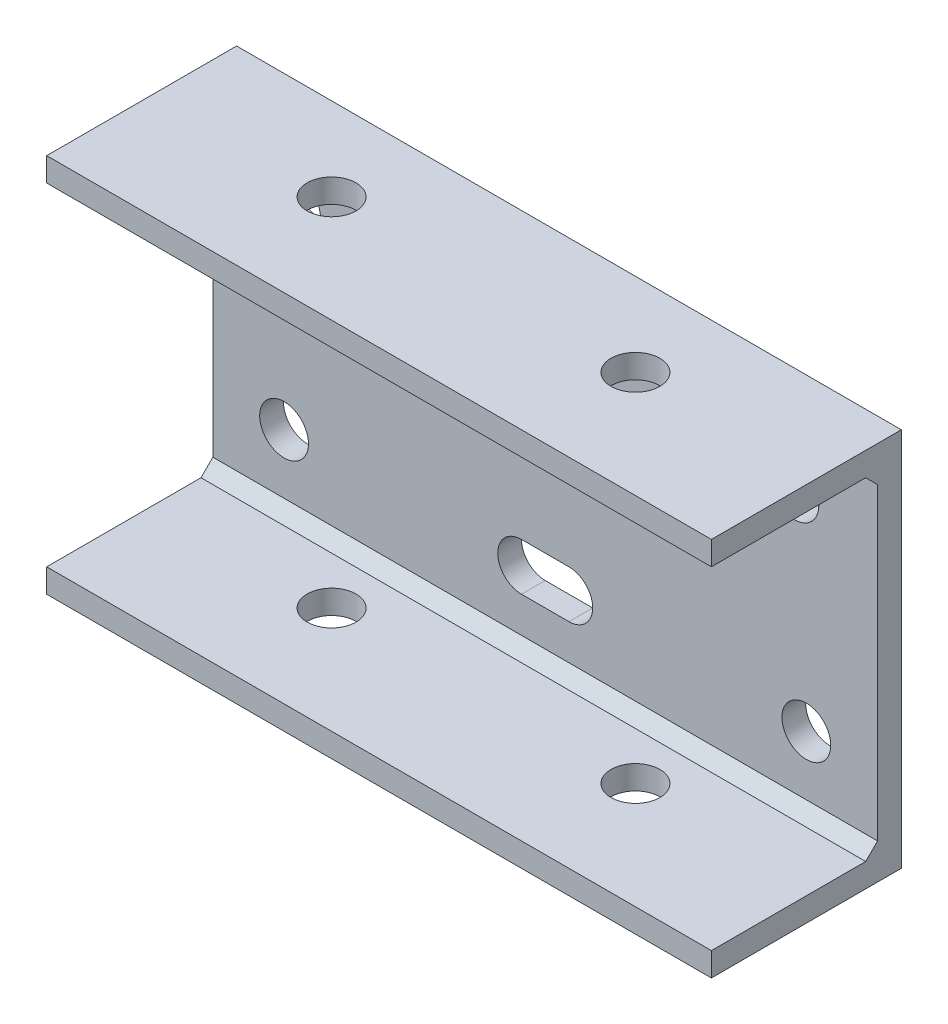
ISO-10303-21;
HEADER;
FILE_DESCRIPTION(('STEP AP214'),'2;1');
FILE_NAME('part.step','',(''),(''),'','','');
FILE_SCHEMA(('AUTOMOTIVE_DESIGN { 1 0 10303 214 1 1 1 1 }'));
ENDSEC;
DATA;
#1=APPLICATION_CONTEXT('core data for automotive mechanical design processes');
#2=APPLICATION_PROTOCOL_DEFINITION('international standard','automotive_design',2000,#1);
#3=PRODUCT_CONTEXT('',#1,'mechanical');
#4=PRODUCT('Part','Part','',(#3));
#5=PRODUCT_RELATED_PRODUCT_CATEGORY('part','',(#4));
#6=PRODUCT_DEFINITION_FORMATION('','',#4);
#7=PRODUCT_DEFINITION_CONTEXT('part definition',#1,'design');
#8=PRODUCT_DEFINITION('design','',#6,#7);
#9=PRODUCT_DEFINITION_SHAPE('','',#8);
#10=(LENGTH_UNIT() NAMED_UNIT(*) SI_UNIT(.MILLI.,.METRE.));
#11=(NAMED_UNIT(*) PLANE_ANGLE_UNIT() SI_UNIT($,.RADIAN.));
#12=(NAMED_UNIT(*) SI_UNIT($,.STERADIAN.) SOLID_ANGLE_UNIT());
#13=UNCERTAINTY_MEASURE_WITH_UNIT(LENGTH_MEASURE(1.E-05),#10,'distance_accuracy_value','');
#14=(GEOMETRIC_REPRESENTATION_CONTEXT(3) GLOBAL_UNCERTAINTY_ASSIGNED_CONTEXT((#13)) GLOBAL_UNIT_ASSIGNED_CONTEXT((#10,
#11,#12)) REPRESENTATION_CONTEXT('',''));
#15=CARTESIAN_POINT('',(0.,0.,0.));
#16=DIRECTION('',(0.,0.,1.));
#17=DIRECTION('',(1.,0.,0.));
#18=AXIS2_PLACEMENT_3D('',#15,#16,#17);
#19=CARTESIAN_POINT('',(23.8252,24.7399999992,11.1252));
#20=DIRECTION('',(0.,1.,0.));
#21=DIRECTION('',(0.,0.,1.));
#22=AXIS2_PLACEMENT_3D('',#19,#20,#21);
#23=CYLINDRICAL_SURFACE('',#22,3.2639);
#24=CARTESIAN_POINT('',(23.8252,50.8,11.1252));
#25=DIRECTION('',(0.,1.,0.));
#26=DIRECTION('',(0.,0.,1.));
#27=AXIS2_PLACEMENT_3D('',#24,#25,#26);
#28=CIRCLE('',#27,3.2639);
#29=CARTESIAN_POINT('',(23.8252,50.8,14.3891));
#30=VERTEX_POINT('',#29);
#31=EDGE_CURVE('E145',#30,#30,#28,.T.);
#32=ORIENTED_EDGE('',*,*,#31,.T.);
#33=EDGE_LOOP('',(#32));
#34=FACE_BOUND('',#33,.T.);
#35=CARTESIAN_POINT('',(23.8252,47.625,11.1252));
#36=DIRECTION('',(0.,1.,0.));
#37=DIRECTION('',(0.,0.,1.));
#38=AXIS2_PLACEMENT_3D('',#35,#36,#37);
#39=CIRCLE('',#38,3.2639);
#40=CARTESIAN_POINT('',(23.8252,47.625,14.3891));
#41=VERTEX_POINT('',#40);
#42=EDGE_CURVE('E20',#41,#41,#39,.F.);
#43=ORIENTED_EDGE('',*,*,#42,.T.);
#44=EDGE_LOOP('',(#43));
#45=FACE_BOUND('',#44,.T.);
#46=ADVANCED_FACE('F17',(#34,#45),#23,.F.);
#47=CARTESIAN_POINT('',(64.4652,24.7399999992,11.1252));
#48=DIRECTION('',(0.,1.,0.));
#49=DIRECTION('',(0.,0.,1.));
#50=AXIS2_PLACEMENT_3D('',#47,#48,#49);
#51=CYLINDRICAL_SURFACE('',#50,3.2639);
#52=CARTESIAN_POINT('',(64.4652,50.8,11.1252));
#53=DIRECTION('',(0.,1.,0.));
#54=DIRECTION('',(0.,0.,1.));
#55=AXIS2_PLACEMENT_3D('',#52,#53,#54);
#56=CIRCLE('',#55,3.2639);
#57=CARTESIAN_POINT('',(64.4652,50.8,14.3891));
#58=VERTEX_POINT('',#57);
#59=EDGE_CURVE('E141',#58,#58,#56,.T.);
#60=ORIENTED_EDGE('',*,*,#59,.T.);
#61=EDGE_LOOP('',(#60));
#62=FACE_BOUND('',#61,.T.);
#63=CARTESIAN_POINT('',(64.4652,47.625,11.1252));
#64=DIRECTION('',(0.,1.,0.));
#65=DIRECTION('',(0.,0.,1.));
#66=AXIS2_PLACEMENT_3D('',#63,#64,#65);
#67=CIRCLE('',#66,3.2639);
#68=CARTESIAN_POINT('',(64.4652,47.625,14.3891));
#69=VERTEX_POINT('',#68);
#70=EDGE_CURVE('E97',#69,#69,#67,.F.);
#71=ORIENTED_EDGE('',*,*,#70,.T.);
#72=EDGE_LOOP('',(#71));
#73=FACE_BOUND('',#72,.T.);
#74=ADVANCED_FACE('F474',(#62,#73),#51,.F.);
#75=CARTESIAN_POINT('',(44.45,3.175,4.7625));
#76=DIRECTION('',(0.,0.707106781186548,0.707106781186548));
#77=DIRECTION('',(0.,-0.707106781186548,0.707106781186548));
#78=AXIS2_PLACEMENT_3D('',#75,#76,#77);
#79=PLANE('',#78);
#80=DIRECTION('',(0.,-0.707106781186547,0.707106781186547));
#81=VECTOR('',#80,1.);
#82=CARTESIAN_POINT('',(88.9,4.7625,3.175));
#83=LINE('',#82,#81);
#84=CARTESIAN_POINT('',(88.9,4.7625,3.175));
#85=VERTEX_POINT('',#84);
#86=CARTESIAN_POINT('',(88.9,3.175,4.7625));
#87=VERTEX_POINT('',#86);
#88=EDGE_CURVE('E197',#85,#87,#83,.T.);
#89=ORIENTED_EDGE('',*,*,#88,.F.);
#90=DIRECTION('',(-1.,0.,0.));
#91=VECTOR('',#90,1.);
#92=CARTESIAN_POINT('',(0.,4.7625,3.175));
#93=LINE('',#92,#91);
#94=CARTESIAN_POINT('',(0.,4.7625,3.175));
#95=VERTEX_POINT('',#94);
#96=EDGE_CURVE('E199',#85,#95,#93,.T.);
#97=ORIENTED_EDGE('',*,*,#96,.T.);
#98=DIRECTION('',(0.,-0.707106781186547,0.707106781186547));
#99=VECTOR('',#98,1.);
#100=CARTESIAN_POINT('',(0.,4.7625,3.175));
#101=LINE('',#100,#99);
#102=CARTESIAN_POINT('',(0.,3.175,4.7625));
#103=VERTEX_POINT('',#102);
#104=EDGE_CURVE('E144',#95,#103,#101,.T.);
#105=ORIENTED_EDGE('',*,*,#104,.T.);
#106=DIRECTION('',(1.,0.,0.));
#107=VECTOR('',#106,1.);
#108=CARTESIAN_POINT('',(0.,3.175,4.7625));
#109=LINE('',#108,#107);
#110=EDGE_CURVE('E101',#103,#87,#109,.T.);
#111=ORIENTED_EDGE('',*,*,#110,.T.);
#112=EDGE_LOOP('',(#89,#97,#105,#111));
#113=FACE_BOUND('',#112,.T.);
#114=ADVANCED_FACE('F464',(#113),#79,.T.);
#115=CARTESIAN_POINT('',(0.,3.175,25.4));
#116=DIRECTION('',(0.,-1.,0.));
#117=DIRECTION('',(0.,0.,-1.));
#118=AXIS2_PLACEMENT_3D('',#115,#116,#117);
#119=PLANE('',#118);
#120=CARTESIAN_POINT('',(64.4652,3.175,11.1252));
#121=DIRECTION('',(0.,1.,0.));
#122=DIRECTION('',(0.,0.,1.));
#123=AXIS2_PLACEMENT_3D('',#120,#121,#122);
#124=CIRCLE('',#123,3.2639);
#125=CARTESIAN_POINT('',(64.4652,3.175,14.3891));
#126=VERTEX_POINT('',#125);
#127=EDGE_CURVE('E149',#126,#126,#124,.F.);
#128=ORIENTED_EDGE('',*,*,#127,.T.);
#129=EDGE_LOOP('',(#128));
#130=FACE_BOUND('',#129,.T.);
#131=CARTESIAN_POINT('',(23.8252,3.175,11.1252));
#132=DIRECTION('',(0.,1.,0.));
#133=DIRECTION('',(0.,0.,1.));
#134=AXIS2_PLACEMENT_3D('',#131,#132,#133);
#135=CIRCLE('',#134,3.2639);
#136=CARTESIAN_POINT('',(23.8252,3.175,14.3891));
#137=VERTEX_POINT('',#136);
#138=EDGE_CURVE('E93',#137,#137,#135,.F.);
#139=ORIENTED_EDGE('',*,*,#138,.T.);
#140=EDGE_LOOP('',(#139));
#141=FACE_BOUND('',#140,.T.);
#142=DIRECTION('',(0.,0.,-1.));
#143=VECTOR('',#142,1.);
#144=CARTESIAN_POINT('',(0.,3.175,0.));
#145=LINE('',#144,#143);
#146=CARTESIAN_POINT('',(0.,3.175,25.4));
#147=VERTEX_POINT('',#146);
#148=EDGE_CURVE('E229',#103,#147,#145,.F.);
#149=ORIENTED_EDGE('',*,*,#148,.T.);
#150=DIRECTION('',(-1.,0.,0.));
#151=VECTOR('',#150,1.);
#152=CARTESIAN_POINT('',(0.,3.175,25.4));
#153=LINE('',#152,#151);
#154=CARTESIAN_POINT('',(88.9,3.175,25.4));
#155=VERTEX_POINT('',#154);
#156=EDGE_CURVE('E90',#147,#155,#153,.F.);
#157=ORIENTED_EDGE('',*,*,#156,.T.);
#158=DIRECTION('',(0.,0.,-1.));
#159=VECTOR('',#158,1.);
#160=CARTESIAN_POINT('',(88.9,3.175,0.));
#161=LINE('',#160,#159);
#162=EDGE_CURVE('E194',#87,#155,#161,.F.);
#163=ORIENTED_EDGE('',*,*,#162,.F.);
#164=ORIENTED_EDGE('',*,*,#110,.F.);
#165=EDGE_LOOP('',(#149,#157,#163,#164));
#166=FACE_BOUND('',#165,.T.);
#167=ADVANCED_FACE('F454',(#130,#141,#166),#119,.F.);
#168=CARTESIAN_POINT('',(0.,47.625,25.4));
#169=DIRECTION('',(0.,0.,-1.));
#170=DIRECTION('',(-1.,0.,0.));
#171=AXIS2_PLACEMENT_3D('',#168,#169,#170);
#172=PLANE('',#171);
#173=DIRECTION('',(0.,1.,0.));
#174=VECTOR('',#173,1.);
#175=CARTESIAN_POINT('',(0.,0.,25.4));
#176=LINE('',#175,#174);
#177=CARTESIAN_POINT('',(0.,50.8,25.4));
#178=VERTEX_POINT('',#177);
#179=CARTESIAN_POINT('',(0.,47.625,25.4));
#180=VERTEX_POINT('',#179);
#181=EDGE_CURVE('E238',#178,#180,#176,.F.);
#182=ORIENTED_EDGE('',*,*,#181,.T.);
#183=DIRECTION('',(1.,0.,0.));
#184=VECTOR('',#183,1.);
#185=CARTESIAN_POINT('',(0.,47.625,25.4));
#186=LINE('',#185,#184);
#187=CARTESIAN_POINT('',(88.9,47.625,25.4));
#188=VERTEX_POINT('',#187);
#189=EDGE_CURVE('E98',#180,#188,#186,.T.);
#190=ORIENTED_EDGE('',*,*,#189,.T.);
#191=DIRECTION('',(0.,1.,0.));
#192=VECTOR('',#191,1.);
#193=CARTESIAN_POINT('',(88.9,0.,25.4));
#194=LINE('',#193,#192);
#195=CARTESIAN_POINT('',(88.9,50.8,25.4));
#196=VERTEX_POINT('',#195);
#197=EDGE_CURVE('E184',#196,#188,#194,.F.);
#198=ORIENTED_EDGE('',*,*,#197,.F.);
#199=DIRECTION('',(1.,0.,0.));
#200=VECTOR('',#199,1.);
#201=CARTESIAN_POINT('',(0.,50.8,25.4));
#202=LINE('',#201,#200);
#203=EDGE_CURVE('E148',#196,#178,#202,.F.);
#204=ORIENTED_EDGE('',*,*,#203,.T.);
#205=EDGE_LOOP('',(#182,#190,#198,#204));
#206=FACE_BOUND('',#205,.T.);
#207=ADVANCED_FACE('F164',(#206),#172,.F.);
#208=CARTESIAN_POINT('',(0.,47.625,3.175));
#209=DIRECTION('',(0.,1.,0.));
#210=DIRECTION('',(0.,0.,1.));
#211=AXIS2_PLACEMENT_3D('',#208,#209,#210);
#212=PLANE('',#211);
#213=ORIENTED_EDGE('',*,*,#70,.F.);
#214=EDGE_LOOP('',(#213));
#215=FACE_BOUND('',#214,.T.);
#216=ORIENTED_EDGE('',*,*,#42,.F.);
#217=EDGE_LOOP('',(#216));
#218=FACE_BOUND('',#217,.T.);
#219=DIRECTION('',(0.,0.,-1.));
#220=VECTOR('',#219,1.);
#221=CARTESIAN_POINT('',(88.9,47.625,0.));
#222=LINE('',#221,#220);
#223=CARTESIAN_POINT('',(88.9,47.625,4.7625));
#224=VERTEX_POINT('',#223);
#225=EDGE_CURVE('E172',#188,#224,#222,.T.);
#226=ORIENTED_EDGE('',*,*,#225,.F.);
#227=ORIENTED_EDGE('',*,*,#189,.F.);
#228=DIRECTION('',(0.,0.,-1.));
#229=VECTOR('',#228,1.);
#230=CARTESIAN_POINT('',(0.,47.625,0.));
#231=LINE('',#230,#229);
#232=CARTESIAN_POINT('',(0.,47.625,4.7625));
#233=VERTEX_POINT('',#232);
#234=EDGE_CURVE('E241',#180,#233,#231,.T.);
#235=ORIENTED_EDGE('',*,*,#234,.T.);
#236=DIRECTION('',(1.,0.,0.));
#237=VECTOR('',#236,1.);
#238=CARTESIAN_POINT('',(44.45,47.625,4.7625));
#239=LINE('',#238,#237);
#240=EDGE_CURVE('E94',#224,#233,#239,.F.);
#241=ORIENTED_EDGE('',*,*,#240,.F.);
#242=EDGE_LOOP('',(#226,#227,#235,#241));
#243=FACE_BOUND('',#242,.T.);
#244=ADVANCED_FACE('F160',(#215,#218,#243),#212,.F.);
#245=CARTESIAN_POINT('',(44.45,46.0375,3.175));
#246=DIRECTION('',(0.,-0.707106781186548,0.707106781186548));
#247=DIRECTION('',(0.,-0.707106781186548,-0.707106781186548));
#248=AXIS2_PLACEMENT_3D('',#245,#246,#247);
#249=PLANE('',#248);
#250=DIRECTION('',(0.,-0.707106781186547,-0.707106781186548));
#251=VECTOR('',#250,1.);
#252=CARTESIAN_POINT('',(88.9,47.625,4.7625));
#253=LINE('',#252,#251);
#254=CARTESIAN_POINT('',(88.9,46.0375,3.175));
#255=VERTEX_POINT('',#254);
#256=EDGE_CURVE('E183',#224,#255,#253,.T.);
#257=ORIENTED_EDGE('',*,*,#256,.F.);
#258=ORIENTED_EDGE('',*,*,#240,.T.);
#259=DIRECTION('',(0.,-0.707106781186547,-0.707106781186548));
#260=VECTOR('',#259,1.);
#261=CARTESIAN_POINT('',(0.,47.625,4.7625));
#262=LINE('',#261,#260);
#263=CARTESIAN_POINT('',(0.,46.0375,3.175));
#264=VERTEX_POINT('',#263);
#265=EDGE_CURVE('E215',#233,#264,#262,.T.);
#266=ORIENTED_EDGE('',*,*,#265,.T.);
#267=DIRECTION('',(-1.,0.,0.));
#268=VECTOR('',#267,1.);
#269=CARTESIAN_POINT('',(0.,46.0375,3.175));
#270=LINE('',#269,#268);
#271=EDGE_CURVE('E85',#264,#255,#270,.F.);
#272=ORIENTED_EDGE('',*,*,#271,.T.);
#273=EDGE_LOOP('',(#257,#258,#266,#272));
#274=FACE_BOUND('',#273,.T.);
#275=ADVANCED_FACE('F163',(#274),#249,.T.);
#276=CARTESIAN_POINT('',(0.,47.625,25.4));
#277=DIRECTION('',(0.,0.,-1.));
#278=DIRECTION('',(-1.,0.,0.));
#279=AXIS2_PLACEMENT_3D('',#276,#277,#278);
#280=PLANE('',#279);
#281=DIRECTION('',(0.,1.,0.));
#282=VECTOR('',#281,1.);
#283=CARTESIAN_POINT('',(0.,0.,25.4));
#284=LINE('',#283,#282);
#285=CARTESIAN_POINT('',(0.,0.,25.4));
#286=VERTEX_POINT('',#285);
#287=EDGE_CURVE('E232',#147,#286,#284,.F.);
#288=ORIENTED_EDGE('',*,*,#287,.T.);
#289=DIRECTION('',(1.,0.,0.));
#290=VECTOR('',#289,1.);
#291=CARTESIAN_POINT('',(0.,0.,25.4));
#292=LINE('',#291,#290);
#293=CARTESIAN_POINT('',(88.9,0.,25.4));
#294=VERTEX_POINT('',#293);
#295=EDGE_CURVE('E140',#286,#294,#292,.T.);
#296=ORIENTED_EDGE('',*,*,#295,.T.);
#297=DIRECTION('',(0.,1.,0.));
#298=VECTOR('',#297,1.);
#299=CARTESIAN_POINT('',(88.9,0.,25.4));
#300=LINE('',#299,#298);
#301=EDGE_CURVE('E188',#155,#294,#300,.F.);
#302=ORIENTED_EDGE('',*,*,#301,.F.);
#303=ORIENTED_EDGE('',*,*,#156,.F.);
#304=EDGE_LOOP('',(#288,#296,#302,#303));
#305=FACE_BOUND('',#304,.T.);
#306=ADVANCED_FACE('F421',(#305),#280,.F.);
#307=CARTESIAN_POINT('',(23.8252,24.7399999992,11.1252));
#308=DIRECTION('',(0.,1.,0.));
#309=DIRECTION('',(0.,0.,1.));
#310=AXIS2_PLACEMENT_3D('',#307,#308,#309);
#311=CYLINDRICAL_SURFACE('',#310,3.2639);
#312=CARTESIAN_POINT('',(23.8252,0.,11.1252));
#313=DIRECTION('',(0.,1.,0.));
#314=DIRECTION('',(0.,0.,1.));
#315=AXIS2_PLACEMENT_3D('',#312,#313,#314);
#316=CIRCLE('',#315,3.2639);
#317=CARTESIAN_POINT('',(23.8252,0.,14.3891));
#318=VERTEX_POINT('',#317);
#319=EDGE_CURVE('E137',#318,#318,#316,.F.);
#320=ORIENTED_EDGE('',*,*,#319,.T.);
#321=EDGE_LOOP('',(#320));
#322=FACE_BOUND('',#321,.T.);
#323=ORIENTED_EDGE('',*,*,#138,.F.);
#324=EDGE_LOOP('',(#323));
#325=FACE_BOUND('',#324,.T.);
#326=ADVANCED_FACE('F411',(#322,#325),#311,.F.);
#327=CARTESIAN_POINT('',(64.4652,24.7399999992,11.1252));
#328=DIRECTION('',(0.,1.,0.));
#329=DIRECTION('',(0.,0.,1.));
#330=AXIS2_PLACEMENT_3D('',#327,#328,#329);
#331=CYLINDRICAL_SURFACE('',#330,3.2639);
#332=CARTESIAN_POINT('',(64.4652,0.,11.1252));
#333=DIRECTION('',(0.,1.,0.));
#334=DIRECTION('',(0.,0.,1.));
#335=AXIS2_PLACEMENT_3D('',#332,#333,#334);
#336=CIRCLE('',#335,3.2639);
#337=CARTESIAN_POINT('',(64.4652,0.,14.3891));
#338=VERTEX_POINT('',#337);
#339=EDGE_CURVE('E134',#338,#338,#336,.F.);
#340=ORIENTED_EDGE('',*,*,#339,.T.);
#341=EDGE_LOOP('',(#340));
#342=FACE_BOUND('',#341,.T.);
#343=ORIENTED_EDGE('',*,*,#127,.F.);
#344=EDGE_LOOP('',(#343));
#345=FACE_BOUND('',#344,.T.);
#346=ADVANCED_FACE('F402',(#342,#345),#331,.F.);
#347=CARTESIAN_POINT('',(0.,3.175,3.175));
#348=DIRECTION('',(0.,0.,-1.));
#349=DIRECTION('',(-1.,0.,0.));
#350=AXIS2_PLACEMENT_3D('',#347,#348,#349);
#351=PLANE('',#350);
#352=DIRECTION('',(1.,0.,0.));
#353=VECTOR('',#352,1.);
#354=CARTESIAN_POINT('',(41.275,15.875,3.175));
#355=LINE('',#354,#353);
#356=CARTESIAN_POINT('',(47.625,15.875,3.175));
#357=VERTEX_POINT('',#356);
#358=CARTESIAN_POINT('',(41.275,15.875,3.175));
#359=VERTEX_POINT('',#358);
#360=EDGE_CURVE('E87',#357,#359,#355,.F.);
#361=ORIENTED_EDGE('',*,*,#360,.F.);
#362=CARTESIAN_POINT('',(47.625,12.7,3.175));
#363=DIRECTION('',(0.,0.,1.));
#364=DIRECTION('',(1.,0.,0.));
#365=AXIS2_PLACEMENT_3D('',#362,#363,#364);
#366=CIRCLE('',#365,3.175);
#367=CARTESIAN_POINT('',(47.625,9.525,3.175));
#368=VERTEX_POINT('',#367);
#369=EDGE_CURVE('E72',#357,#368,#366,.F.);
#370=ORIENTED_EDGE('',*,*,#369,.T.);
#371=DIRECTION('',(1.,0.,0.));
#372=VECTOR('',#371,1.);
#373=CARTESIAN_POINT('',(41.275,9.525,3.175));
#374=LINE('',#373,#372);
#375=CARTESIAN_POINT('',(41.275,9.525,3.175));
#376=VERTEX_POINT('',#375);
#377=EDGE_CURVE('E71',#368,#376,#374,.F.);
#378=ORIENTED_EDGE('',*,*,#377,.T.);
#379=CARTESIAN_POINT('',(41.275,12.7,3.175));
#380=DIRECTION('',(0.,0.,1.));
#381=DIRECTION('',(1.,0.,0.));
#382=AXIS2_PLACEMENT_3D('',#379,#380,#381);
#383=CIRCLE('',#382,3.175);
#384=EDGE_CURVE('E59',#376,#359,#383,.F.);
#385=ORIENTED_EDGE('',*,*,#384,.T.);
#386=EDGE_LOOP('',(#361,#370,#378,#385));
#387=FACE_BOUND('',#386,.T.);
#388=CARTESIAN_POINT('',(79.375,12.7,3.175));
#389=DIRECTION('',(0.,0.,1.));
#390=DIRECTION('',(1.,0.,0.));
#391=AXIS2_PLACEMENT_3D('',#388,#389,#390);
#392=CIRCLE('',#391,3.2639);
#393=CARTESIAN_POINT('',(82.6389,12.7,3.175));
#394=VERTEX_POINT('',#393);
#395=EDGE_CURVE('E68',#394,#394,#392,.F.);
#396=ORIENTED_EDGE('',*,*,#395,.T.);
#397=EDGE_LOOP('',(#396));
#398=FACE_BOUND('',#397,.T.);
#399=CARTESIAN_POINT('',(77.7748,39.6748,3.175));
#400=DIRECTION('',(0.,0.,1.));
#401=DIRECTION('',(1.,0.,0.));
#402=AXIS2_PLACEMENT_3D('',#399,#400,#401);
#403=CIRCLE('',#402,3.2639);
#404=CARTESIAN_POINT('',(81.0387,39.6748,3.175));
#405=VERTEX_POINT('',#404);
#406=EDGE_CURVE('E125',#405,#405,#403,.F.);
#407=ORIENTED_EDGE('',*,*,#406,.T.);
#408=EDGE_LOOP('',(#407));
#409=FACE_BOUND('',#408,.T.);
#410=CARTESIAN_POINT('',(11.1252,39.6748,3.175));
#411=DIRECTION('',(0.,0.,1.));
#412=DIRECTION('',(1.,0.,0.));
#413=AXIS2_PLACEMENT_3D('',#410,#411,#412);
#414=CIRCLE('',#413,3.2639);
#415=CARTESIAN_POINT('',(14.3891,39.6748,3.175));
#416=VERTEX_POINT('',#415);
#417=EDGE_CURVE('E128',#416,#416,#414,.F.);
#418=ORIENTED_EDGE('',*,*,#417,.T.);
#419=EDGE_LOOP('',(#418));
#420=FACE_BOUND('',#419,.T.);
#421=CARTESIAN_POINT('',(9.525,12.7,3.175));
#422=DIRECTION('',(0.,0.,1.));
#423=DIRECTION('',(1.,0.,0.));
#424=AXIS2_PLACEMENT_3D('',#421,#422,#423);
#425=CIRCLE('',#424,3.2639);
#426=CARTESIAN_POINT('',(12.7889,12.7,3.175));
#427=VERTEX_POINT('',#426);
#428=EDGE_CURVE('E131',#427,#427,#425,.F.);
#429=ORIENTED_EDGE('',*,*,#428,.T.);
#430=EDGE_LOOP('',(#429));
#431=FACE_BOUND('',#430,.T.);
#432=DIRECTION('',(0.,1.,0.));
#433=VECTOR('',#432,1.);
#434=CARTESIAN_POINT('',(88.9,0.,3.175));
#435=LINE('',#434,#433);
#436=EDGE_CURVE('E186',#255,#85,#435,.F.);
#437=ORIENTED_EDGE('',*,*,#436,.F.);
#438=ORIENTED_EDGE('',*,*,#271,.F.);
#439=DIRECTION('',(0.,1.,0.));
#440=VECTOR('',#439,1.);
#441=CARTESIAN_POINT('',(0.,0.,3.175));
#442=LINE('',#441,#440);
#443=EDGE_CURVE('E244',#264,#95,#442,.F.);
#444=ORIENTED_EDGE('',*,*,#443,.T.);
#445=ORIENTED_EDGE('',*,*,#96,.F.);
#446=EDGE_LOOP('',(#437,#438,#444,#445));
#447=FACE_BOUND('',#446,.T.);
#448=ADVANCED_FACE('F74',(#387,#398,#409,#420,#431,#447),#351,.F.);
#449=CARTESIAN_POINT('',(88.9,0.,0.));
#450=DIRECTION('',(1.,0.,0.));
#451=DIRECTION('',(0.,0.,-1.));
#452=AXIS2_PLACEMENT_3D('',#449,#450,#451);
#453=PLANE('',#452);
#454=ORIENTED_EDGE('',*,*,#256,.T.);
#455=ORIENTED_EDGE('',*,*,#436,.T.);
#456=ORIENTED_EDGE('',*,*,#88,.T.);
#457=ORIENTED_EDGE('',*,*,#162,.T.);
#458=ORIENTED_EDGE('',*,*,#301,.T.);
#459=DIRECTION('',(0.,0.,1.));
#460=VECTOR('',#459,1.);
#461=CARTESIAN_POINT('',(88.9,0.,0.));
#462=LINE('',#461,#460);
#463=CARTESIAN_POINT('',(88.9,0.,0.));
#464=VERTEX_POINT('',#463);
#465=EDGE_CURVE('E246',#294,#464,#462,.F.);
#466=ORIENTED_EDGE('',*,*,#465,.T.);
#467=DIRECTION('',(0.,1.,0.));
#468=VECTOR('',#467,1.);
#469=CARTESIAN_POINT('',(88.9,50.8,0.));
#470=LINE('',#469,#468);
#471=CARTESIAN_POINT('',(88.9,50.8,0.));
#472=VERTEX_POINT('',#471);
#473=EDGE_CURVE('E77',#464,#472,#470,.T.);
#474=ORIENTED_EDGE('',*,*,#473,.T.);
#475=DIRECTION('',(0.,0.,-1.));
#476=VECTOR('',#475,1.);
#477=CARTESIAN_POINT('',(88.9,50.8,25.4));
#478=LINE('',#477,#476);
#479=EDGE_CURVE('E222',#472,#196,#478,.F.);
#480=ORIENTED_EDGE('',*,*,#479,.T.);
#481=ORIENTED_EDGE('',*,*,#197,.T.);
#482=ORIENTED_EDGE('',*,*,#225,.T.);
#483=EDGE_LOOP('',(#454,#455,#456,#457,#458,#466,#474,#480,#481,#482));
#484=FACE_BOUND('',#483,.T.);
#485=ADVANCED_FACE('F384',(#484),#453,.T.);
#486=CARTESIAN_POINT('',(0.,50.8,25.4));
#487=DIRECTION('',(0.,-1.,0.));
#488=DIRECTION('',(0.,0.,-1.));
#489=AXIS2_PLACEMENT_3D('',#486,#487,#488);
#490=PLANE('',#489);
#491=ORIENTED_EDGE('',*,*,#59,.F.);
#492=EDGE_LOOP('',(#491));
#493=FACE_BOUND('',#492,.T.);
#494=ORIENTED_EDGE('',*,*,#31,.F.);
#495=EDGE_LOOP('',(#494));
#496=FACE_BOUND('',#495,.T.);
#497=DIRECTION('',(0.,0.,-1.));
#498=VECTOR('',#497,1.);
#499=CARTESIAN_POINT('',(0.,50.8,0.));
#500=LINE('',#499,#498);
#501=CARTESIAN_POINT('',(0.,50.8,0.));
#502=VERTEX_POINT('',#501);
#503=EDGE_CURVE('E235',#502,#178,#500,.F.);
#504=ORIENTED_EDGE('',*,*,#503,.T.);
#505=ORIENTED_EDGE('',*,*,#203,.F.);
#506=ORIENTED_EDGE('',*,*,#479,.F.);
#507=DIRECTION('',(1.,0.,0.));
#508=VECTOR('',#507,1.);
#509=CARTESIAN_POINT('',(0.,50.8,0.));
#510=LINE('',#509,#508);
#511=EDGE_CURVE('E80',#472,#502,#510,.F.);
#512=ORIENTED_EDGE('',*,*,#511,.T.);
#513=EDGE_LOOP('',(#504,#505,#506,#512));
#514=FACE_BOUND('',#513,.T.);
#515=ADVANCED_FACE('F374',(#493,#496,#514),#490,.F.);
#516=CARTESIAN_POINT('',(0.,0.,0.));
#517=DIRECTION('',(1.,0.,0.));
#518=DIRECTION('',(0.,0.,-1.));
#519=AXIS2_PLACEMENT_3D('',#516,#517,#518);
#520=PLANE('',#519);
#521=ORIENTED_EDGE('',*,*,#265,.F.);
#522=ORIENTED_EDGE('',*,*,#234,.F.);
#523=ORIENTED_EDGE('',*,*,#181,.F.);
#524=ORIENTED_EDGE('',*,*,#503,.F.);
#525=DIRECTION('',(0.,1.,0.));
#526=VECTOR('',#525,1.);
#527=CARTESIAN_POINT('',(0.,50.8,0.));
#528=LINE('',#527,#526);
#529=CARTESIAN_POINT('',(0.,0.,0.));
#530=VERTEX_POINT('',#529);
#531=EDGE_CURVE('E259',#502,#530,#528,.F.);
#532=ORIENTED_EDGE('',*,*,#531,.T.);
#533=DIRECTION('',(0.,0.,1.));
#534=VECTOR('',#533,1.);
#535=CARTESIAN_POINT('',(0.,0.,0.));
#536=LINE('',#535,#534);
#537=EDGE_CURVE('E249',#530,#286,#536,.T.);
#538=ORIENTED_EDGE('',*,*,#537,.T.);
#539=ORIENTED_EDGE('',*,*,#287,.F.);
#540=ORIENTED_EDGE('',*,*,#148,.F.);
#541=ORIENTED_EDGE('',*,*,#104,.F.);
#542=ORIENTED_EDGE('',*,*,#443,.F.);
#543=EDGE_LOOP('',(#521,#522,#523,#524,#532,#538,#539,#540,#541,#542));
#544=FACE_BOUND('',#543,.T.);
#545=ADVANCED_FACE('F364',(#544),#520,.F.);
#546=CARTESIAN_POINT('',(0.,0.,0.));
#547=DIRECTION('',(0.,1.,0.));
#548=DIRECTION('',(0.,0.,1.));
#549=AXIS2_PLACEMENT_3D('',#546,#547,#548);
#550=PLANE('',#549);
#551=ORIENTED_EDGE('',*,*,#339,.F.);
#552=EDGE_LOOP('',(#551));
#553=FACE_BOUND('',#552,.T.);
#554=ORIENTED_EDGE('',*,*,#319,.F.);
#555=EDGE_LOOP('',(#554));
#556=FACE_BOUND('',#555,.T.);
#557=ORIENTED_EDGE('',*,*,#537,.F.);
#558=DIRECTION('',(1.,0.,0.));
#559=VECTOR('',#558,1.);
#560=CARTESIAN_POINT('',(0.,0.,0.));
#561=LINE('',#560,#559);
#562=EDGE_CURVE('E121',#530,#464,#561,.T.);
#563=ORIENTED_EDGE('',*,*,#562,.T.);
#564=ORIENTED_EDGE('',*,*,#465,.F.);
#565=ORIENTED_EDGE('',*,*,#295,.F.);
#566=EDGE_LOOP('',(#557,#563,#564,#565));
#567=FACE_BOUND('',#566,.T.);
#568=ADVANCED_FACE('F354',(#553,#556,#567),#550,.F.);
#569=CARTESIAN_POINT('',(9.525,12.7,13.36));
#570=DIRECTION('',(0.,0.,1.));
#571=DIRECTION('',(1.,0.,0.));
#572=AXIS2_PLACEMENT_3D('',#569,#570,#571);
#573=CYLINDRICAL_SURFACE('',#572,3.2639);
#574=CARTESIAN_POINT('',(9.525,12.7,0.));
#575=DIRECTION('',(0.,0.,1.));
#576=DIRECTION('',(1.,0.,0.));
#577=AXIS2_PLACEMENT_3D('',#574,#575,#576);
#578=CIRCLE('',#577,3.2639);
#579=CARTESIAN_POINT('',(12.7889,12.7,0.));
#580=VERTEX_POINT('',#579);
#581=EDGE_CURVE('E118',#580,#580,#578,.F.);
#582=ORIENTED_EDGE('',*,*,#581,.T.);
#583=EDGE_LOOP('',(#582));
#584=FACE_BOUND('',#583,.T.);
#585=ORIENTED_EDGE('',*,*,#428,.F.);
#586=EDGE_LOOP('',(#585));
#587=FACE_BOUND('',#586,.T.);
#588=ADVANCED_FACE('F344',(#584,#587),#573,.F.);
#589=CARTESIAN_POINT('',(11.1252,39.6748,13.36));
#590=DIRECTION('',(0.,0.,1.));
#591=DIRECTION('',(1.,0.,0.));
#592=AXIS2_PLACEMENT_3D('',#589,#590,#591);
#593=CYLINDRICAL_SURFACE('',#592,3.2639);
#594=CARTESIAN_POINT('',(11.1252,39.6748,0.));
#595=DIRECTION('',(0.,0.,1.));
#596=DIRECTION('',(1.,0.,0.));
#597=AXIS2_PLACEMENT_3D('',#594,#595,#596);
#598=CIRCLE('',#597,3.2639);
#599=CARTESIAN_POINT('',(14.3891,39.6748,0.));
#600=VERTEX_POINT('',#599);
#601=EDGE_CURVE('E115',#600,#600,#598,.F.);
#602=ORIENTED_EDGE('',*,*,#601,.T.);
#603=EDGE_LOOP('',(#602));
#604=FACE_BOUND('',#603,.T.);
#605=ORIENTED_EDGE('',*,*,#417,.F.);
#606=EDGE_LOOP('',(#605));
#607=FACE_BOUND('',#606,.T.);
#608=ADVANCED_FACE('F334',(#604,#607),#593,.F.);
#609=CARTESIAN_POINT('',(77.7748,39.6748,13.36));
#610=DIRECTION('',(0.,0.,1.));
#611=DIRECTION('',(1.,0.,0.));
#612=AXIS2_PLACEMENT_3D('',#609,#610,#611);
#613=CYLINDRICAL_SURFACE('',#612,3.2639);
#614=CARTESIAN_POINT('',(77.7748,39.6748,0.));
#615=DIRECTION('',(0.,0.,1.));
#616=DIRECTION('',(1.,0.,0.));
#617=AXIS2_PLACEMENT_3D('',#614,#615,#616);
#618=CIRCLE('',#617,3.2639);
#619=CARTESIAN_POINT('',(81.0387,39.6748,0.));
#620=VERTEX_POINT('',#619);
#621=EDGE_CURVE('E112',#620,#620,#618,.F.);
#622=ORIENTED_EDGE('',*,*,#621,.T.);
#623=EDGE_LOOP('',(#622));
#624=FACE_BOUND('',#623,.T.);
#625=ORIENTED_EDGE('',*,*,#406,.F.);
#626=EDGE_LOOP('',(#625));
#627=FACE_BOUND('',#626,.T.);
#628=ADVANCED_FACE('F324',(#624,#627),#613,.F.);
#629=CARTESIAN_POINT('',(79.375,12.7,13.36));
#630=DIRECTION('',(0.,0.,1.));
#631=DIRECTION('',(1.,0.,0.));
#632=AXIS2_PLACEMENT_3D('',#629,#630,#631);
#633=CYLINDRICAL_SURFACE('',#632,3.2639);
#634=CARTESIAN_POINT('',(79.375,12.7,0.));
#635=DIRECTION('',(0.,0.,1.));
#636=DIRECTION('',(1.,0.,0.));
#637=AXIS2_PLACEMENT_3D('',#634,#635,#636);
#638=CIRCLE('',#637,3.2639);
#639=CARTESIAN_POINT('',(82.6389,12.7,0.));
#640=VERTEX_POINT('',#639);
#641=EDGE_CURVE('E109',#640,#640,#638,.F.);
#642=ORIENTED_EDGE('',*,*,#641,.T.);
#643=EDGE_LOOP('',(#642));
#644=FACE_BOUND('',#643,.T.);
#645=ORIENTED_EDGE('',*,*,#395,.F.);
#646=EDGE_LOOP('',(#645));
#647=FACE_BOUND('',#646,.T.);
#648=ADVANCED_FACE('F315',(#644,#647),#633,.F.);
#649=CARTESIAN_POINT('',(41.275,12.7,13.36));
#650=DIRECTION('',(0.,0.,1.));
#651=DIRECTION('',(1.,0.,0.));
#652=AXIS2_PLACEMENT_3D('',#649,#650,#651);
#653=CYLINDRICAL_SURFACE('',#652,3.175);
#654=DIRECTION('',(0.,0.,-1.));
#655=VECTOR('',#654,1.);
#656=CARTESIAN_POINT('',(41.275,9.525,0.));
#657=LINE('',#656,#655);
#658=CARTESIAN_POINT('',(41.275,9.525,0.));
#659=VERTEX_POINT('',#658);
#660=EDGE_CURVE('E63',#376,#659,#657,.T.);
#661=ORIENTED_EDGE('',*,*,#660,.T.);
#662=CARTESIAN_POINT('',(41.275,12.7,0.));
#663=DIRECTION('',(0.,0.,1.));
#664=DIRECTION('',(1.,0.,0.));
#665=AXIS2_PLACEMENT_3D('',#662,#663,#664);
#666=CIRCLE('',#665,3.175);
#667=CARTESIAN_POINT('',(41.275,15.875,0.));
#668=VERTEX_POINT('',#667);
#669=EDGE_CURVE('E107',#659,#668,#666,.F.);
#670=ORIENTED_EDGE('',*,*,#669,.T.);
#671=DIRECTION('',(0.,0.,-1.));
#672=VECTOR('',#671,1.);
#673=CARTESIAN_POINT('',(41.275,15.875,0.));
#674=LINE('',#673,#672);
#675=EDGE_CURVE('E64',#359,#668,#674,.T.);
#676=ORIENTED_EDGE('',*,*,#675,.F.);
#677=ORIENTED_EDGE('',*,*,#384,.F.);
#678=EDGE_LOOP('',(#661,#670,#676,#677));
#679=FACE_BOUND('',#678,.T.);
#680=ADVANCED_FACE('F61',(#679),#653,.F.);
#681=CARTESIAN_POINT('',(41.275,15.875,0.));
#682=DIRECTION('',(0.,-1.,0.));
#683=DIRECTION('',(0.,0.,-1.));
#684=AXIS2_PLACEMENT_3D('',#681,#682,#683);
#685=PLANE('',#684);
#686=DIRECTION('',(0.,0.,1.));
#687=VECTOR('',#686,1.);
#688=CARTESIAN_POINT('',(47.625,15.875,13.36));
#689=LINE('',#688,#687);
#690=CARTESIAN_POINT('',(47.625,15.875,0.));
#691=VERTEX_POINT('',#690);
#692=EDGE_CURVE('E89',#691,#357,#689,.T.);
#693=ORIENTED_EDGE('',*,*,#692,.T.);
#694=ORIENTED_EDGE('',*,*,#360,.T.);
#695=ORIENTED_EDGE('',*,*,#675,.T.);
#696=DIRECTION('',(1.,0.,0.));
#697=VECTOR('',#696,1.);
#698=CARTESIAN_POINT('',(0.,15.875,0.));
#699=LINE('',#698,#697);
#700=EDGE_CURVE('E106',#668,#691,#699,.T.);
#701=ORIENTED_EDGE('',*,*,#700,.T.);
#702=EDGE_LOOP('',(#693,#694,#695,#701));
#703=FACE_BOUND('',#702,.T.);
#704=ADVANCED_FACE('F267',(#703),#685,.T.);
#705=CARTESIAN_POINT('',(47.625,12.7,13.36));
#706=DIRECTION('',(0.,0.,1.));
#707=DIRECTION('',(1.,0.,0.));
#708=AXIS2_PLACEMENT_3D('',#705,#706,#707);
#709=CYLINDRICAL_SURFACE('',#708,3.175);
#710=ORIENTED_EDGE('',*,*,#692,.F.);
#711=CARTESIAN_POINT('',(47.625,12.7,0.));
#712=DIRECTION('',(0.,0.,1.));
#713=DIRECTION('',(1.,0.,0.));
#714=AXIS2_PLACEMENT_3D('',#711,#712,#713);
#715=CIRCLE('',#714,3.175);
#716=CARTESIAN_POINT('',(47.625,9.525,0.));
#717=VERTEX_POINT('',#716);
#718=EDGE_CURVE('E26',#691,#717,#715,.F.);
#719=ORIENTED_EDGE('',*,*,#718,.T.);
#720=DIRECTION('',(0.,0.,-1.));
#721=VECTOR('',#720,1.);
#722=CARTESIAN_POINT('',(47.625,9.525,0.));
#723=LINE('',#722,#721);
#724=EDGE_CURVE('E34',#717,#368,#723,.F.);
#725=ORIENTED_EDGE('',*,*,#724,.T.);
#726=ORIENTED_EDGE('',*,*,#369,.F.);
#727=EDGE_LOOP('',(#710,#719,#725,#726));
#728=FACE_BOUND('',#727,.T.);
#729=ADVANCED_FACE('F273',(#728),#709,.F.);
#730=CARTESIAN_POINT('',(41.275,9.525,0.));
#731=DIRECTION('',(0.,-1.,0.));
#732=DIRECTION('',(0.,0.,-1.));
#733=AXIS2_PLACEMENT_3D('',#730,#731,#732);
#734=PLANE('',#733);
#735=ORIENTED_EDGE('',*,*,#724,.F.);
#736=DIRECTION('',(1.,0.,0.));
#737=VECTOR('',#736,1.);
#738=CARTESIAN_POINT('',(0.,9.525,0.));
#739=LINE('',#738,#737);
#740=EDGE_CURVE('E11',#717,#659,#739,.F.);
#741=ORIENTED_EDGE('',*,*,#740,.T.);
#742=ORIENTED_EDGE('',*,*,#660,.F.);
#743=ORIENTED_EDGE('',*,*,#377,.F.);
#744=EDGE_LOOP('',(#735,#741,#742,#743));
#745=FACE_BOUND('',#744,.T.);
#746=ADVANCED_FACE('F70',(#745),#734,.F.);
#747=CARTESIAN_POINT('',(0.,50.8,0.));
#748=DIRECTION('',(0.,0.,1.));
#749=DIRECTION('',(1.,0.,0.));
#750=AXIS2_PLACEMENT_3D('',#747,#748,#749);
#751=PLANE('',#750);
#752=ORIENTED_EDGE('',*,*,#718,.F.);
#753=ORIENTED_EDGE('',*,*,#700,.F.);
#754=ORIENTED_EDGE('',*,*,#669,.F.);
#755=ORIENTED_EDGE('',*,*,#740,.F.);
#756=EDGE_LOOP('',(#752,#753,#754,#755));
#757=FACE_BOUND('',#756,.T.);
#758=ORIENTED_EDGE('',*,*,#641,.F.);
#759=EDGE_LOOP('',(#758));
#760=FACE_BOUND('',#759,.T.);
#761=ORIENTED_EDGE('',*,*,#621,.F.);
#762=EDGE_LOOP('',(#761));
#763=FACE_BOUND('',#762,.T.);
#764=ORIENTED_EDGE('',*,*,#601,.F.);
#765=EDGE_LOOP('',(#764));
#766=FACE_BOUND('',#765,.T.);
#767=ORIENTED_EDGE('',*,*,#581,.F.);
#768=EDGE_LOOP('',(#767));
#769=FACE_BOUND('',#768,.T.);
#770=ORIENTED_EDGE('',*,*,#531,.F.);
#771=ORIENTED_EDGE('',*,*,#511,.F.);
#772=ORIENTED_EDGE('',*,*,#473,.F.);
#773=ORIENTED_EDGE('',*,*,#562,.F.);
#774=EDGE_LOOP('',(#770,#771,#772,#773));
#775=FACE_BOUND('',#774,.T.);
#776=ADVANCED_FACE('F270',(#757,#760,#763,#766,#769,#775),#751,.F.);
#777=CLOSED_SHELL('',(#46,#74,#114,#167,#207,#244,#275,#306,#326,#346,#448,#485,#515,#545,#568,
#588,#608,#628,#648,#680,#704,#729,#746,#776));
#778=MANIFOLD_SOLID_BREP('B1',#777);
#779=ADVANCED_BREP_SHAPE_REPRESENTATION('',(#18,#778),#14);
#780=SHAPE_DEFINITION_REPRESENTATION(#9,#779);
ENDSEC;
END-ISO-10303-21;
